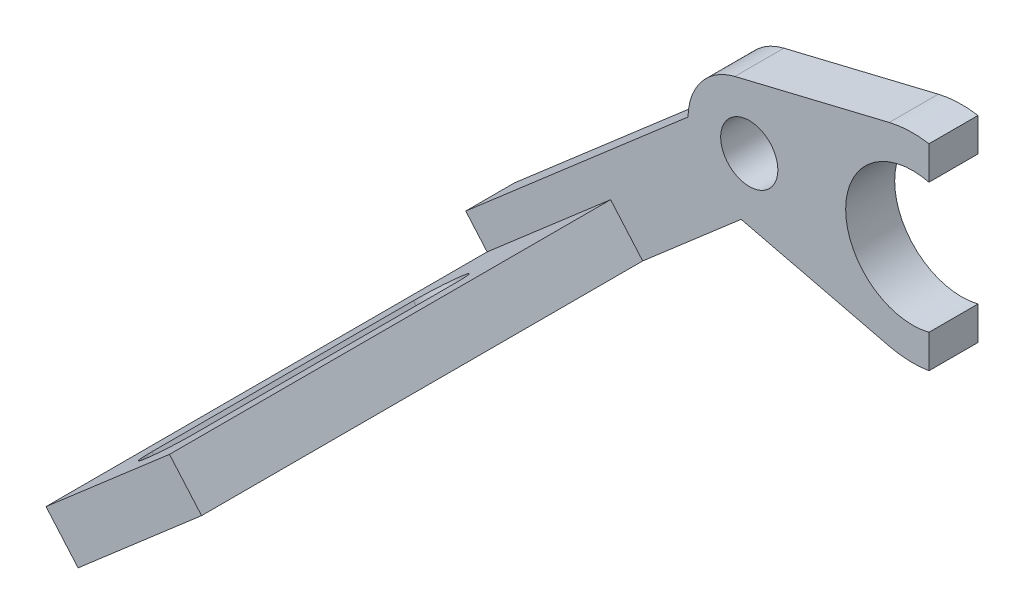
ISO-10303-21;
HEADER;
FILE_DESCRIPTION(('STEP AP214'),'2;1');
FILE_NAME('part.step','',(''),(''),'','','');
FILE_SCHEMA(('AUTOMOTIVE_DESIGN { 1 0 10303 214 1 1 1 1 }'));
ENDSEC;
DATA;
#1=APPLICATION_CONTEXT('core data for automotive mechanical design processes');
#2=APPLICATION_PROTOCOL_DEFINITION('international standard','automotive_design',2000,#1);
#3=PRODUCT_CONTEXT('',#1,'mechanical');
#4=PRODUCT('Part','Part','',(#3));
#5=PRODUCT_RELATED_PRODUCT_CATEGORY('part','',(#4));
#6=PRODUCT_DEFINITION_FORMATION('','',#4);
#7=PRODUCT_DEFINITION_CONTEXT('part definition',#1,'design');
#8=PRODUCT_DEFINITION('design','',#6,#7);
#9=PRODUCT_DEFINITION_SHAPE('','',#8);
#10=(LENGTH_UNIT() NAMED_UNIT(*) SI_UNIT(.MILLI.,.METRE.));
#11=(NAMED_UNIT(*) PLANE_ANGLE_UNIT() SI_UNIT($,.RADIAN.));
#12=(NAMED_UNIT(*) SI_UNIT($,.STERADIAN.) SOLID_ANGLE_UNIT());
#13=UNCERTAINTY_MEASURE_WITH_UNIT(LENGTH_MEASURE(1.E-05),#10,'distance_accuracy_value','');
#14=(GEOMETRIC_REPRESENTATION_CONTEXT(3) GLOBAL_UNCERTAINTY_ASSIGNED_CONTEXT((#13)) GLOBAL_UNIT_ASSIGNED_CONTEXT((#10,
#11,#12)) REPRESENTATION_CONTEXT('',''));
#15=CARTESIAN_POINT('',(0.,0.,0.));
#16=DIRECTION('',(0.,0.,1.));
#17=DIRECTION('',(1.,0.,0.));
#18=AXIS2_PLACEMENT_3D('',#15,#16,#17);
#19=CARTESIAN_POINT('',(-0.88125,3.64498263884754,3.));
#20=DIRECTION('',(-0.235,0.971995370359345,0.));
#21=DIRECTION('',(-0.971995370359345,-0.235,0.));
#22=AXIS2_PLACEMENT_3D('',#19,#20,#21);
#23=PLANE('',#22);
#24=DIRECTION('',(0.971995370359345,0.235,0.));
#25=VECTOR('',#24,1.);
#26=CARTESIAN_POINT('',(-0.88125,3.64498263884754,0.));
#27=LINE('',#26,#25);
#28=CARTESIAN_POINT('',(-0.881249999999999,3.64498263884754,0.));
#29=VERTEX_POINT('',#28);
#30=CARTESIAN_POINT('',(8.5665,5.929171759192,0.));
#31=VERTEX_POINT('',#30);
#32=EDGE_CURVE('E151',#29,#31,#27,.T.);
#33=ORIENTED_EDGE('',*,*,#32,.F.);
#34=DIRECTION('',(0.,0.,-1.));
#35=VECTOR('',#34,1.);
#36=CARTESIAN_POINT('',(-0.881249999999999,3.64498263884754,3.));
#37=LINE('',#36,#35);
#38=CARTESIAN_POINT('',(-0.881249999999999,3.64498263884754,3.));
#39=VERTEX_POINT('',#38);
#40=EDGE_CURVE('E11',#39,#29,#37,.T.);
#41=ORIENTED_EDGE('',*,*,#40,.F.);
#42=DIRECTION('',(0.971995370359345,0.235,0.));
#43=VECTOR('',#42,1.);
#44=CARTESIAN_POINT('',(-0.88125,3.64498263884754,3.));
#45=LINE('',#44,#43);
#46=CARTESIAN_POINT('',(8.5665,5.929171759192,3.));
#47=VERTEX_POINT('',#46);
#48=EDGE_CURVE('E180',#39,#47,#45,.T.);
#49=ORIENTED_EDGE('',*,*,#48,.T.);
#50=DIRECTION('',(0.,0.,-1.));
#51=VECTOR('',#50,1.);
#52=CARTESIAN_POINT('',(8.5665,5.929171759192,3.));
#53=LINE('',#52,#51);
#54=EDGE_CURVE('E95',#47,#31,#53,.T.);
#55=ORIENTED_EDGE('',*,*,#54,.T.);
#56=EDGE_LOOP('',(#33,#41,#49,#55));
#57=FACE_BOUND('',#56,.T.);
#58=ADVANCED_FACE('F35',(#57),#23,.T.);
#59=CARTESIAN_POINT('',(0.,0.,3.));
#60=DIRECTION('',(0.,0.,-1.));
#61=DIRECTION('',(-1.,0.,0.));
#62=AXIS2_PLACEMENT_3D('',#59,#60,#61);
#63=CYLINDRICAL_SURFACE('',#62,3.75);
#64=CARTESIAN_POINT('',(0.,0.,0.));
#65=DIRECTION('',(0.,0.,1.));
#66=DIRECTION('',(1.,0.,0.));
#67=AXIS2_PLACEMENT_3D('',#64,#65,#66);
#68=CIRCLE('',#67,3.75);
#69=CARTESIAN_POINT('',(-3.7495267069032,0.0595774640247476,0.));
#70=VERTEX_POINT('',#69);
#71=EDGE_CURVE('E154',#29,#70,#68,.T.);
#72=ORIENTED_EDGE('',*,*,#71,.T.);
#73=DIRECTION('',(0.,0.,-1.));
#74=VECTOR('',#73,1.);
#75=CARTESIAN_POINT('',(-3.7495267069032,0.0595774640247476,3.));
#76=LINE('',#75,#74);
#77=CARTESIAN_POINT('',(-3.7495267069032,0.0595774640247476,3.));
#78=VERTEX_POINT('',#77);
#79=EDGE_CURVE('E43',#78,#70,#76,.T.);
#80=ORIENTED_EDGE('',*,*,#79,.F.);
#81=CARTESIAN_POINT('',(0.,0.,3.));
#82=DIRECTION('',(0.,0.,1.));
#83=DIRECTION('',(1.,0.,0.));
#84=AXIS2_PLACEMENT_3D('',#81,#82,#83);
#85=CIRCLE('',#84,3.75);
#86=EDGE_CURVE('E226',#39,#78,#85,.T.);
#87=ORIENTED_EDGE('',*,*,#86,.F.);
#88=ORIENTED_EDGE('',*,*,#40,.T.);
#89=EDGE_LOOP('',(#72,#80,#87,#88));
#90=FACE_BOUND('',#89,.T.);
#91=ADVANCED_FACE('F370',(#90),#63,.T.);
#92=CARTESIAN_POINT('',(-1.63685203429334,1.88963367291911,3.));
#93=DIRECTION('',(0.654740813717336,-0.755853469167643,0.));
#94=DIRECTION('',(0.755853469167643,0.654740813717336,0.));
#95=AXIS2_PLACEMENT_3D('',#92,#93,#94);
#96=PLANE('',#95);
#97=DIRECTION('',(-0.755853469167643,-0.654740813717336,0.));
#98=VECTOR('',#97,1.);
#99=CARTESIAN_POINT('',(-1.63685203429334,1.88963367291911,0.));
#100=LINE('',#99,#98);
#101=CARTESIAN_POINT('',(-17.3548891519208,-11.7257571828873,0.));
#102=VERTEX_POINT('',#101);
#103=EDGE_CURVE('E157',#70,#102,#100,.T.);
#104=ORIENTED_EDGE('',*,*,#103,.T.);
#105=DIRECTION('',(0.,0.,-1.));
#106=VECTOR('',#105,1.);
#107=CARTESIAN_POINT('',(-17.3548891519208,-11.7257571828873,3.));
#108=LINE('',#107,#106);
#109=CARTESIAN_POINT('',(-17.3548891519208,-11.7257571828873,3.));
#110=VERTEX_POINT('',#109);
#111=EDGE_CURVE('E194',#110,#102,#108,.T.);
#112=ORIENTED_EDGE('',*,*,#111,.F.);
#113=DIRECTION('',(-0.755853469167643,-0.654740813717336,0.));
#114=VECTOR('',#113,1.);
#115=CARTESIAN_POINT('',(-1.63685203429334,1.88963367291911,3.));
#116=LINE('',#115,#114);
#117=EDGE_CURVE('E204',#78,#110,#116,.T.);
#118=ORIENTED_EDGE('',*,*,#117,.F.);
#119=ORIENTED_EDGE('',*,*,#79,.T.);
#120=EDGE_LOOP('',(#104,#112,#118,#119));
#121=FACE_BOUND('',#120,.T.);
#122=ADVANCED_FACE('F201',(#121),#96,.F.);
#123=CARTESIAN_POINT('',(-15.7180371176274,-13.6153908558064,3.));
#124=DIRECTION('',(-0.755853469167643,-0.654740813717336,0.));
#125=DIRECTION('',(0.654740813717336,-0.755853469167643,0.));
#126=AXIS2_PLACEMENT_3D('',#123,#124,#125);
#127=PLANE('',#126);
#128=ORIENTED_EDGE('',*,*,#111,.T.);
#129=DIRECTION('',(-0.654740813717336,0.755853469167643,0.));
#130=VECTOR('',#129,1.);
#131=CARTESIAN_POINT('',(-15.7180371176274,-13.6153908558064,0.));
#132=LINE('',#131,#130);
#133=CARTESIAN_POINT('',(-14.0811850833341,-15.5050245287255,0.));
#134=VERTEX_POINT('',#133);
#135=EDGE_CURVE('E160',#134,#102,#132,.T.);
#136=ORIENTED_EDGE('',*,*,#135,.F.);
#137=DIRECTION('',(0.,0.,-1.));
#138=VECTOR('',#137,1.);
#139=CARTESIAN_POINT('',(-14.0811850833341,-15.5050245287255,3.));
#140=LINE('',#139,#138);
#141=CARTESIAN_POINT('',(-14.0811850833341,-15.5050245287255,30.));
#142=VERTEX_POINT('',#141);
#143=EDGE_CURVE('E191',#142,#134,#140,.T.);
#144=ORIENTED_EDGE('',*,*,#143,.F.);
#145=DIRECTION('',(0.654740813717335,-0.755853469167643,0.));
#146=VECTOR('',#145,1.);
#147=CARTESIAN_POINT('',(-16.0454075244861,-13.2374641212226,30.));
#148=LINE('',#147,#146);
#149=CARTESIAN_POINT('',(-16.0454075244861,-13.2374641212226,30.));
#150=VERTEX_POINT('',#149);
#151=EDGE_CURVE('E248',#150,#142,#148,.T.);
#152=ORIENTED_EDGE('',*,*,#151,.F.);
#153=DIRECTION('',(0.,0.,-1.));
#154=VECTOR('',#153,1.);
#155=CARTESIAN_POINT('',(-16.0454075244861,-13.2374641212226,0.));
#156=LINE('',#155,#154);
#157=CARTESIAN_POINT('',(-16.0454075244861,-13.2374641212226,3.));
#158=VERTEX_POINT('',#157);
#159=EDGE_CURVE('E222',#150,#158,#156,.T.);
#160=ORIENTED_EDGE('',*,*,#159,.T.);
#161=DIRECTION('',(-0.654740813717336,0.755853469167643,0.));
#162=VECTOR('',#161,1.);
#163=CARTESIAN_POINT('',(-15.7180371176274,-13.6153908558064,3.));
#164=LINE('',#163,#162);
#165=EDGE_CURVE('E218',#158,#110,#164,.T.);
#166=ORIENTED_EDGE('',*,*,#165,.T.);
#167=EDGE_LOOP('',(#128,#136,#144,#152,#160,#166));
#168=FACE_BOUND('',#167,.T.);
#169=ADVANCED_FACE('F215',(#168),#127,.T.);
#170=CARTESIAN_POINT('',(1.63685203429334,-1.88963367291911,3.));
#171=DIRECTION('',(0.654740813717336,-0.755853469167643,0.));
#172=DIRECTION('',(0.755853469167643,0.654740813717336,0.));
#173=AXIS2_PLACEMENT_3D('',#170,#171,#172);
#174=PLANE('',#173);
#175=DIRECTION('',(-0.755853469167643,-0.654740813717336,0.));
#176=VECTOR('',#175,1.);
#177=CARTESIAN_POINT('',(1.63685203429334,-1.88963367291911,3.));
#178=LINE('',#177,#176);
#179=CARTESIAN_POINT('',(-0.496863485241732,-3.73791603516074,3.));
#180=VERTEX_POINT('',#179);
#181=CARTESIAN_POINT('',(-6.52265039165767,-8.95761639155215,3.));
#182=VERTEX_POINT('',#181);
#183=EDGE_CURVE('E224',#180,#182,#178,.T.);
#184=ORIENTED_EDGE('',*,*,#183,.T.);
#185=DIRECTION('',(0.,0.,1.));
#186=VECTOR('',#185,1.);
#187=CARTESIAN_POINT('',(-6.52265039165767,-8.95761639155215,0.));
#188=LINE('',#187,#186);
#189=CARTESIAN_POINT('',(-6.52265039165767,-8.95761639155215,30.));
#190=VERTEX_POINT('',#189);
#191=EDGE_CURVE('E258',#182,#190,#188,.T.);
#192=ORIENTED_EDGE('',*,*,#191,.T.);
#193=DIRECTION('',(-0.755853469167643,-0.654740813717335,0.));
#194=VECTOR('',#193,1.);
#195=CARTESIAN_POINT('',(-14.0811850833341,-15.5050245287255,30.));
#196=LINE('',#195,#194);
#197=EDGE_CURVE('E255',#190,#142,#196,.T.);
#198=ORIENTED_EDGE('',*,*,#197,.T.);
#199=ORIENTED_EDGE('',*,*,#143,.T.);
#200=DIRECTION('',(-0.755853469167643,-0.654740813717336,0.));
#201=VECTOR('',#200,1.);
#202=CARTESIAN_POINT('',(1.63685203429334,-1.88963367291911,0.));
#203=LINE('',#202,#201);
#204=CARTESIAN_POINT('',(-0.496863485241732,-3.73791603516074,0.));
#205=VERTEX_POINT('',#204);
#206=EDGE_CURVE('E162',#205,#134,#203,.T.);
#207=ORIENTED_EDGE('',*,*,#206,.F.);
#208=DIRECTION('',(0.,0.,-1.));
#209=VECTOR('',#208,1.);
#210=CARTESIAN_POINT('',(-0.496863485241732,-3.73791603516074,3.));
#211=LINE('',#210,#209);
#212=EDGE_CURVE('E189',#180,#205,#211,.T.);
#213=ORIENTED_EDGE('',*,*,#212,.F.);
#214=EDGE_LOOP('',(#184,#192,#198,#199,#207,#213));
#215=FACE_BOUND('',#214,.T.);
#216=DIRECTION('',(0.,0.,-1.));
#217=VECTOR('',#216,1.);
#218=CARTESIAN_POINT('',(-11.5868686350809,-13.3443798434583,26.));
#219=LINE('',#218,#217);
#220=CARTESIAN_POINT('',(-11.5868686350809,-13.3443798434583,26.));
#221=VERTEX_POINT('',#220);
#222=CARTESIAN_POINT('',(-11.5868686350809,-13.3443798434583,10.));
#223=VERTEX_POINT('',#222);
#224=EDGE_CURVE('E287',#221,#223,#219,.T.);
#225=ORIENTED_EDGE('',*,*,#224,.F.);
#226=CARTESIAN_POINT('',(-10.3019177374959,-12.2313204601388,26.));
#227=DIRECTION('',(0.654740813717336,-0.755853469167643,0.));
#228=DIRECTION('',(0.755853469167643,0.654740813717336,0.));
#229=AXIS2_PLACEMENT_3D('',#226,#227,#228);
#230=CIRCLE('',#229,1.7);
#231=CARTESIAN_POINT('',(-9.01696683991089,-11.1182610768194,26.));
#232=VERTEX_POINT('',#231);
#233=EDGE_CURVE('E290',#232,#221,#230,.T.);
#234=ORIENTED_EDGE('',*,*,#233,.F.);
#235=DIRECTION('',(0.,0.,1.));
#236=VECTOR('',#235,1.);
#237=CARTESIAN_POINT('',(-9.01696683991089,-11.1182610768194,26.));
#238=LINE('',#237,#236);
#239=CARTESIAN_POINT('',(-9.01696683991089,-11.1182610768194,10.));
#240=VERTEX_POINT('',#239);
#241=EDGE_CURVE('E280',#240,#232,#238,.T.);
#242=ORIENTED_EDGE('',*,*,#241,.F.);
#243=CARTESIAN_POINT('',(-10.3019177374959,-12.2313204601388,10.));
#244=DIRECTION('',(0.654740813717336,-0.755853469167643,0.));
#245=DIRECTION('',(0.755853469167643,0.654740813717336,0.));
#246=AXIS2_PLACEMENT_3D('',#243,#244,#245);
#247=CIRCLE('',#246,1.7);
#248=EDGE_CURVE('E284',#223,#240,#247,.T.);
#249=ORIENTED_EDGE('',*,*,#248,.F.);
#250=EDGE_LOOP('',(#225,#234,#242,#249));
#251=FACE_BOUND('',#250,.T.);
#252=ADVANCED_FACE('F352',(#215,#251),#174,.T.);
#253=CARTESIAN_POINT('',(-0.88125,-3.64498263884754,3.));
#254=DIRECTION('',(0.235,0.971995370359345,0.));
#255=DIRECTION('',(-0.971995370359345,0.235,0.));
#256=AXIS2_PLACEMENT_3D('',#253,#254,#255);
#257=PLANE('',#256);
#258=DIRECTION('',(0.971995370359345,-0.235,0.));
#259=VECTOR('',#258,1.);
#260=CARTESIAN_POINT('',(-0.88125,-3.64498263884754,0.));
#261=LINE('',#260,#259);
#262=CARTESIAN_POINT('',(8.5665,-5.929171759192,0.));
#263=VERTEX_POINT('',#262);
#264=EDGE_CURVE('E164',#205,#263,#261,.T.);
#265=ORIENTED_EDGE('',*,*,#264,.T.);
#266=DIRECTION('',(0.,0.,-1.));
#267=VECTOR('',#266,1.);
#268=CARTESIAN_POINT('',(8.5665,-5.929171759192,3.));
#269=LINE('',#268,#267);
#270=CARTESIAN_POINT('',(8.5665,-5.929171759192,3.));
#271=VERTEX_POINT('',#270);
#272=EDGE_CURVE('E186',#271,#263,#269,.T.);
#273=ORIENTED_EDGE('',*,*,#272,.F.);
#274=DIRECTION('',(0.971995370359345,-0.235,0.));
#275=VECTOR('',#274,1.);
#276=CARTESIAN_POINT('',(-0.88125,-3.64498263884754,3.));
#277=LINE('',#276,#275);
#278=EDGE_CURVE('E233',#180,#271,#277,.T.);
#279=ORIENTED_EDGE('',*,*,#278,.F.);
#280=ORIENTED_EDGE('',*,*,#212,.T.);
#281=EDGE_LOOP('',(#265,#273,#279,#280));
#282=FACE_BOUND('',#281,.T.);
#283=ADVANCED_FACE('F358',(#282),#257,.F.);
#284=CARTESIAN_POINT('',(10.,0.,3.));
#285=DIRECTION('',(0.,0.,-1.));
#286=DIRECTION('',(-1.,0.,0.));
#287=AXIS2_PLACEMENT_3D('',#284,#285,#286);
#288=CYLINDRICAL_SURFACE('',#287,6.1);
#289=CARTESIAN_POINT('',(10.,0.,0.));
#290=DIRECTION('',(0.,0.,1.));
#291=DIRECTION('',(1.,0.,0.));
#292=AXIS2_PLACEMENT_3D('',#289,#290,#291);
#293=CIRCLE('',#292,6.1);
#294=CARTESIAN_POINT('',(11.,-6.01747455333215,0.));
#295=VERTEX_POINT('',#294);
#296=EDGE_CURVE('E166',#263,#295,#293,.T.);
#297=ORIENTED_EDGE('',*,*,#296,.T.);
#298=DIRECTION('',(0.,0.,-1.));
#299=VECTOR('',#298,1.);
#300=CARTESIAN_POINT('',(11.,-6.01747455333215,3.));
#301=LINE('',#300,#299);
#302=CARTESIAN_POINT('',(11.,-6.01747455333215,3.));
#303=VERTEX_POINT('',#302);
#304=EDGE_CURVE('E184',#303,#295,#301,.T.);
#305=ORIENTED_EDGE('',*,*,#304,.F.);
#306=CARTESIAN_POINT('',(10.,0.,3.));
#307=DIRECTION('',(0.,0.,1.));
#308=DIRECTION('',(1.,0.,0.));
#309=AXIS2_PLACEMENT_3D('',#306,#307,#308);
#310=CIRCLE('',#309,6.1);
#311=EDGE_CURVE('E235',#271,#303,#310,.T.);
#312=ORIENTED_EDGE('',*,*,#311,.F.);
#313=ORIENTED_EDGE('',*,*,#272,.T.);
#314=EDGE_LOOP('',(#297,#305,#312,#313));
#315=FACE_BOUND('',#314,.T.);
#316=ADVANCED_FACE('F360',(#315),#288,.T.);
#317=CARTESIAN_POINT('',(11.,0.,3.));
#318=DIRECTION('',(1.,0.,0.));
#319=DIRECTION('',(0.,0.,-1.));
#320=AXIS2_PLACEMENT_3D('',#317,#318,#319);
#321=PLANE('',#320);
#322=DIRECTION('',(0.,-1.,0.));
#323=VECTOR('',#322,1.);
#324=CARTESIAN_POINT('',(11.,0.,0.));
#325=LINE('',#324,#323);
#326=CARTESIAN_POINT('',(11.,-3.97617907041421,0.));
#327=VERTEX_POINT('',#326);
#328=EDGE_CURVE('E169',#327,#295,#325,.T.);
#329=ORIENTED_EDGE('',*,*,#328,.F.);
#330=DIRECTION('',(0.,0.,-1.));
#331=VECTOR('',#330,1.);
#332=CARTESIAN_POINT('',(11.,-3.97617907041421,3.));
#333=LINE('',#332,#331);
#334=CARTESIAN_POINT('',(11.,-3.97617907041421,3.));
#335=VERTEX_POINT('',#334);
#336=EDGE_CURVE('E133',#335,#327,#333,.T.);
#337=ORIENTED_EDGE('',*,*,#336,.F.);
#338=DIRECTION('',(0.,-1.,0.));
#339=VECTOR('',#338,1.);
#340=CARTESIAN_POINT('',(11.,0.,3.));
#341=LINE('',#340,#339);
#342=EDGE_CURVE('E141',#335,#303,#341,.T.);
#343=ORIENTED_EDGE('',*,*,#342,.T.);
#344=ORIENTED_EDGE('',*,*,#304,.T.);
#345=EDGE_LOOP('',(#329,#337,#343,#344));
#346=FACE_BOUND('',#345,.T.);
#347=ADVANCED_FACE('F238',(#346),#321,.T.);
#348=CARTESIAN_POINT('',(10.,0.,3.));
#349=DIRECTION('',(0.,0.,-1.));
#350=DIRECTION('',(-1.,0.,0.));
#351=AXIS2_PLACEMENT_3D('',#348,#349,#350);
#352=CYLINDRICAL_SURFACE('',#351,4.1);
#353=CARTESIAN_POINT('',(10.,0.,0.));
#354=DIRECTION('',(0.,0.,1.));
#355=DIRECTION('',(1.,0.,0.));
#356=AXIS2_PLACEMENT_3D('',#353,#354,#355);
#357=CIRCLE('',#356,4.1);
#358=CARTESIAN_POINT('',(11.,3.97617907041421,0.));
#359=VERTEX_POINT('',#358);
#360=EDGE_CURVE('E128',#359,#327,#357,.T.);
#361=ORIENTED_EDGE('',*,*,#360,.F.);
#362=DIRECTION('',(0.,0.,-1.));
#363=VECTOR('',#362,1.);
#364=CARTESIAN_POINT('',(11.,3.97617907041421,3.));
#365=LINE('',#364,#363);
#366=CARTESIAN_POINT('',(11.,3.97617907041421,3.));
#367=VERTEX_POINT('',#366);
#368=EDGE_CURVE('E123',#367,#359,#365,.T.);
#369=ORIENTED_EDGE('',*,*,#368,.F.);
#370=CARTESIAN_POINT('',(10.,0.,3.));
#371=DIRECTION('',(0.,0.,1.));
#372=DIRECTION('',(1.,0.,0.));
#373=AXIS2_PLACEMENT_3D('',#370,#371,#372);
#374=CIRCLE('',#373,4.1);
#375=EDGE_CURVE('E126',#367,#335,#374,.T.);
#376=ORIENTED_EDGE('',*,*,#375,.T.);
#377=ORIENTED_EDGE('',*,*,#336,.T.);
#378=EDGE_LOOP('',(#361,#369,#376,#377));
#379=FACE_BOUND('',#378,.T.);
#380=ADVANCED_FACE('F125',(#379),#352,.F.);
#381=CARTESIAN_POINT('',(11.,0.,3.));
#382=DIRECTION('',(1.,0.,0.));
#383=DIRECTION('',(0.,0.,-1.));
#384=AXIS2_PLACEMENT_3D('',#381,#382,#383);
#385=PLANE('',#384);
#386=DIRECTION('',(0.,-1.,0.));
#387=VECTOR('',#386,1.);
#388=CARTESIAN_POINT('',(11.,0.,0.));
#389=LINE('',#388,#387);
#390=CARTESIAN_POINT('',(11.,6.01747455333215,0.));
#391=VERTEX_POINT('',#390);
#392=EDGE_CURVE('E173',#391,#359,#389,.T.);
#393=ORIENTED_EDGE('',*,*,#392,.F.);
#394=DIRECTION('',(0.,0.,-1.));
#395=VECTOR('',#394,1.);
#396=CARTESIAN_POINT('',(11.,6.01747455333215,3.));
#397=LINE('',#396,#395);
#398=CARTESIAN_POINT('',(11.,6.01747455333215,3.));
#399=VERTEX_POINT('',#398);
#400=EDGE_CURVE('E88',#399,#391,#397,.T.);
#401=ORIENTED_EDGE('',*,*,#400,.F.);
#402=DIRECTION('',(0.,-1.,0.));
#403=VECTOR('',#402,1.);
#404=CARTESIAN_POINT('',(11.,0.,3.));
#405=LINE('',#404,#403);
#406=EDGE_CURVE('E139',#399,#367,#405,.T.);
#407=ORIENTED_EDGE('',*,*,#406,.T.);
#408=ORIENTED_EDGE('',*,*,#368,.T.);
#409=EDGE_LOOP('',(#393,#401,#407,#408));
#410=FACE_BOUND('',#409,.T.);
#411=ADVANCED_FACE('F143',(#410),#385,.T.);
#412=CARTESIAN_POINT('',(10.,0.,3.));
#413=DIRECTION('',(0.,0.,-1.));
#414=DIRECTION('',(-1.,0.,0.));
#415=AXIS2_PLACEMENT_3D('',#412,#413,#414);
#416=CYLINDRICAL_SURFACE('',#415,6.1);
#417=CARTESIAN_POINT('',(10.,0.,0.));
#418=DIRECTION('',(0.,0.,1.));
#419=DIRECTION('',(1.,0.,0.));
#420=AXIS2_PLACEMENT_3D('',#417,#418,#419);
#421=CIRCLE('',#420,6.1);
#422=EDGE_CURVE('E175',#391,#31,#421,.T.);
#423=ORIENTED_EDGE('',*,*,#422,.T.);
#424=ORIENTED_EDGE('',*,*,#54,.F.);
#425=CARTESIAN_POINT('',(10.,0.,3.));
#426=DIRECTION('',(0.,0.,1.));
#427=DIRECTION('',(1.,0.,0.));
#428=AXIS2_PLACEMENT_3D('',#425,#426,#427);
#429=CIRCLE('',#428,6.1);
#430=EDGE_CURVE('E51',#399,#47,#429,.T.);
#431=ORIENTED_EDGE('',*,*,#430,.F.);
#432=ORIENTED_EDGE('',*,*,#400,.T.);
#433=EDGE_LOOP('',(#423,#424,#431,#432));
#434=FACE_BOUND('',#433,.T.);
#435=ADVANCED_FACE('F241',(#434),#416,.T.);
#436=CARTESIAN_POINT('',(0.,0.,3.));
#437=DIRECTION('',(0.,0.,-1.));
#438=DIRECTION('',(-1.,0.,0.));
#439=AXIS2_PLACEMENT_3D('',#436,#437,#438);
#440=CYLINDRICAL_SURFACE('',#439,1.75);
#441=CARTESIAN_POINT('',(0.,0.,3.));
#442=DIRECTION('',(0.,0.,1.));
#443=DIRECTION('',(1.,0.,0.));
#444=AXIS2_PLACEMENT_3D('',#441,#442,#443);
#445=CIRCLE('',#444,1.75);
#446=CARTESIAN_POINT('',(1.75,0.,3.));
#447=VERTEX_POINT('',#446);
#448=EDGE_CURVE('E145',#447,#447,#445,.T.);
#449=ORIENTED_EDGE('',*,*,#448,.T.);
#450=EDGE_LOOP('',(#449));
#451=FACE_BOUND('',#450,.T.);
#452=CARTESIAN_POINT('',(0.,0.,0.));
#453=DIRECTION('',(0.,0.,1.));
#454=DIRECTION('',(1.,0.,0.));
#455=AXIS2_PLACEMENT_3D('',#452,#453,#454);
#456=CIRCLE('',#455,1.75);
#457=CARTESIAN_POINT('',(1.75,0.,0.));
#458=VERTEX_POINT('',#457);
#459=EDGE_CURVE('E177',#458,#458,#456,.T.);
#460=ORIENTED_EDGE('',*,*,#459,.F.);
#461=EDGE_LOOP('',(#460));
#462=FACE_BOUND('',#461,.T.);
#463=ADVANCED_FACE('F430',(#451,#462),#440,.F.);
#464=CARTESIAN_POINT('',(0.,0.,3.));
#465=DIRECTION('',(0.,0.,1.));
#466=DIRECTION('',(1.,0.,0.));
#467=AXIS2_PLACEMENT_3D('',#464,#465,#466);
#468=PLANE('',#467);
#469=DIRECTION('',(-0.654740813717335,0.755853469167643,0.));
#470=VECTOR('',#469,1.);
#471=CARTESIAN_POINT('',(-8.15950242595101,-7.06798271863304,3.));
#472=LINE('',#471,#470);
#473=CARTESIAN_POINT('',(-8.48687283280968,-6.69005598404922,3.));
#474=VERTEX_POINT('',#473);
#475=EDGE_CURVE('E155',#182,#474,#472,.T.);
#476=ORIENTED_EDGE('',*,*,#475,.F.);
#477=ORIENTED_EDGE('',*,*,#183,.F.);
#478=ORIENTED_EDGE('',*,*,#278,.T.);
#479=ORIENTED_EDGE('',*,*,#311,.T.);
#480=ORIENTED_EDGE('',*,*,#342,.F.);
#481=ORIENTED_EDGE('',*,*,#375,.F.);
#482=ORIENTED_EDGE('',*,*,#406,.F.);
#483=ORIENTED_EDGE('',*,*,#430,.T.);
#484=ORIENTED_EDGE('',*,*,#48,.F.);
#485=ORIENTED_EDGE('',*,*,#86,.T.);
#486=ORIENTED_EDGE('',*,*,#117,.T.);
#487=ORIENTED_EDGE('',*,*,#165,.F.);
#488=DIRECTION('',(-0.755853469167643,-0.654740813717336,0.));
#489=VECTOR('',#488,1.);
#490=CARTESIAN_POINT('',(-0.327370406858665,0.377926734583819,3.));
#491=LINE('',#490,#489);
#492=EDGE_CURVE('E245',#474,#158,#491,.T.);
#493=ORIENTED_EDGE('',*,*,#492,.F.);
#494=EDGE_LOOP('',(#476,#477,#478,#479,#480,#481,#482,#483,#484,#485,#486,#487,#493));
#495=FACE_BOUND('',#494,.T.);
#496=ORIENTED_EDGE('',*,*,#448,.F.);
#497=EDGE_LOOP('',(#496));
#498=FACE_BOUND('',#497,.T.);
#499=ADVANCED_FACE('F137',(#495,#498),#468,.T.);
#500=CARTESIAN_POINT('',(0.,0.,0.));
#501=DIRECTION('',(0.,0.,1.));
#502=DIRECTION('',(1.,0.,0.));
#503=AXIS2_PLACEMENT_3D('',#500,#501,#502);
#504=PLANE('',#503);
#505=ORIENTED_EDGE('',*,*,#206,.T.);
#506=ORIENTED_EDGE('',*,*,#135,.T.);
#507=ORIENTED_EDGE('',*,*,#103,.F.);
#508=ORIENTED_EDGE('',*,*,#71,.F.);
#509=ORIENTED_EDGE('',*,*,#32,.T.);
#510=ORIENTED_EDGE('',*,*,#422,.F.);
#511=ORIENTED_EDGE('',*,*,#392,.T.);
#512=ORIENTED_EDGE('',*,*,#360,.T.);
#513=ORIENTED_EDGE('',*,*,#328,.T.);
#514=ORIENTED_EDGE('',*,*,#296,.F.);
#515=ORIENTED_EDGE('',*,*,#264,.F.);
#516=EDGE_LOOP('',(#505,#506,#507,#508,#509,#510,#511,#512,#513,#514,#515));
#517=FACE_BOUND('',#516,.T.);
#518=ORIENTED_EDGE('',*,*,#459,.T.);
#519=EDGE_LOOP('',(#518));
#520=FACE_BOUND('',#519,.T.);
#521=ADVANCED_FACE('F208',(#517,#520),#504,.F.);
#522=CARTESIAN_POINT('',(-16.0454075244861,-13.2374641212226,30.));
#523=DIRECTION('',(0.,0.,1.));
#524=DIRECTION('',(1.,0.,0.));
#525=AXIS2_PLACEMENT_3D('',#522,#523,#524);
#526=PLANE('',#525);
#527=ORIENTED_EDGE('',*,*,#197,.F.);
#528=DIRECTION('',(0.654740813717335,-0.755853469167643,0.));
#529=VECTOR('',#528,1.);
#530=CARTESIAN_POINT('',(-8.48687283280968,-6.69005598404922,30.));
#531=LINE('',#530,#529);
#532=CARTESIAN_POINT('',(-8.48687283280968,-6.69005598404922,30.));
#533=VERTEX_POINT('',#532);
#534=EDGE_CURVE('E249',#533,#190,#531,.T.);
#535=ORIENTED_EDGE('',*,*,#534,.F.);
#536=DIRECTION('',(-0.755853469167643,-0.654740813717335,0.));
#537=VECTOR('',#536,1.);
#538=CARTESIAN_POINT('',(-16.0454075244861,-13.2374641212226,30.));
#539=LINE('',#538,#537);
#540=EDGE_CURVE('E252',#533,#150,#539,.T.);
#541=ORIENTED_EDGE('',*,*,#540,.T.);
#542=ORIENTED_EDGE('',*,*,#151,.T.);
#543=EDGE_LOOP('',(#527,#535,#541,#542));
#544=FACE_BOUND('',#543,.T.);
#545=ADVANCED_FACE('F350',(#544),#526,.T.);
#546=CARTESIAN_POINT('',(-8.48687283280968,-6.69005598404922,0.));
#547=DIRECTION('',(0.755853469167643,0.654740813717335,0.));
#548=DIRECTION('',(-0.654740813717335,0.755853469167643,0.));
#549=AXIS2_PLACEMENT_3D('',#546,#547,#548);
#550=PLANE('',#549);
#551=ORIENTED_EDGE('',*,*,#191,.F.);
#552=ORIENTED_EDGE('',*,*,#475,.T.);
#553=DIRECTION('',(0.,0.,1.));
#554=VECTOR('',#553,1.);
#555=CARTESIAN_POINT('',(-8.48687283280968,-6.69005598404922,0.));
#556=LINE('',#555,#554);
#557=EDGE_CURVE('E264',#474,#533,#556,.T.);
#558=ORIENTED_EDGE('',*,*,#557,.T.);
#559=ORIENTED_EDGE('',*,*,#534,.T.);
#560=EDGE_LOOP('',(#551,#552,#558,#559));
#561=FACE_BOUND('',#560,.T.);
#562=ADVANCED_FACE('F344',(#561),#550,.T.);
#563=CARTESIAN_POINT('',(-0.327370406858665,0.377926734583819,0.));
#564=DIRECTION('',(-0.654740813717336,0.755853469167643,0.));
#565=DIRECTION('',(-0.755853469167643,-0.654740813717336,0.));
#566=AXIS2_PLACEMENT_3D('',#563,#564,#565);
#567=PLANE('',#566);
#568=CARTESIAN_POINT('',(-12.2661401786479,-9.9637600526359,26.));
#569=DIRECTION('',(0.654740813717336,-0.755853469167643,0.));
#570=DIRECTION('',(0.755853469167643,0.654740813717336,0.));
#571=AXIS2_PLACEMENT_3D('',#568,#569,#570);
#572=CIRCLE('',#571,1.7);
#573=CARTESIAN_POINT('',(-10.9811892810629,-8.85070066931643,26.));
#574=VERTEX_POINT('',#573);
#575=CARTESIAN_POINT('',(-13.5510910762329,-11.0768194359554,26.));
#576=VERTEX_POINT('',#575);
#577=EDGE_CURVE('E283',#574,#576,#572,.T.);
#578=ORIENTED_EDGE('',*,*,#577,.T.);
#579=DIRECTION('',(0.,0.,-1.));
#580=VECTOR('',#579,1.);
#581=CARTESIAN_POINT('',(-13.5510910762329,-11.0768194359554,26.));
#582=LINE('',#581,#580);
#583=CARTESIAN_POINT('',(-13.5510910762329,-11.0768194359554,10.));
#584=VERTEX_POINT('',#583);
#585=EDGE_CURVE('E298',#576,#584,#582,.T.);
#586=ORIENTED_EDGE('',*,*,#585,.T.);
#587=CARTESIAN_POINT('',(-12.2661401786479,-9.9637600526359,10.));
#588=DIRECTION('',(0.654740813717336,-0.755853469167643,0.));
#589=DIRECTION('',(0.755853469167643,0.654740813717336,0.));
#590=AXIS2_PLACEMENT_3D('',#587,#588,#589);
#591=CIRCLE('',#590,1.7);
#592=CARTESIAN_POINT('',(-10.9811892810629,-8.85070066931643,10.));
#593=VERTEX_POINT('',#592);
#594=EDGE_CURVE('E295',#584,#593,#591,.T.);
#595=ORIENTED_EDGE('',*,*,#594,.T.);
#596=DIRECTION('',(0.,0.,1.));
#597=VECTOR('',#596,1.);
#598=CARTESIAN_POINT('',(-10.9811892810629,-8.85070066931643,26.));
#599=LINE('',#598,#597);
#600=EDGE_CURVE('E272',#593,#574,#599,.T.);
#601=ORIENTED_EDGE('',*,*,#600,.T.);
#602=EDGE_LOOP('',(#578,#586,#595,#601));
#603=FACE_BOUND('',#602,.T.);
#604=ORIENTED_EDGE('',*,*,#557,.F.);
#605=ORIENTED_EDGE('',*,*,#492,.T.);
#606=ORIENTED_EDGE('',*,*,#159,.F.);
#607=ORIENTED_EDGE('',*,*,#540,.F.);
#608=EDGE_LOOP('',(#604,#605,#606,#607));
#609=FACE_BOUND('',#608,.T.);
#610=ADVANCED_FACE('F305',(#603,#609),#567,.T.);
#611=CARTESIAN_POINT('',(-12.2661401786479,-9.9637600526359,26.));
#612=DIRECTION('',(0.654740813717335,-0.755853469167643,0.));
#613=DIRECTION('',(0.755853469167643,0.654740813717335,0.));
#614=AXIS2_PLACEMENT_3D('',#611,#612,#613);
#615=CYLINDRICAL_SURFACE('',#614,1.7);
#616=ORIENTED_EDGE('',*,*,#233,.T.);
#617=DIRECTION('',(0.654740813717335,-0.755853469167643,0.));
#618=VECTOR('',#617,1.);
#619=CARTESIAN_POINT('',(-13.5510910762329,-11.0768194359554,26.));
#620=LINE('',#619,#618);
#621=EDGE_CURVE('E268',#576,#221,#620,.T.);
#622=ORIENTED_EDGE('',*,*,#621,.F.);
#623=ORIENTED_EDGE('',*,*,#577,.F.);
#624=DIRECTION('',(0.654740813717335,-0.755853469167643,0.));
#625=VECTOR('',#624,1.);
#626=CARTESIAN_POINT('',(-10.9811892810629,-8.85070066931643,26.));
#627=LINE('',#626,#625);
#628=EDGE_CURVE('E261',#574,#232,#627,.T.);
#629=ORIENTED_EDGE('',*,*,#628,.T.);
#630=EDGE_LOOP('',(#616,#622,#623,#629));
#631=FACE_BOUND('',#630,.T.);
#632=ADVANCED_FACE('F316',(#631),#615,.F.);
#633=CARTESIAN_POINT('',(-10.9811892810629,-8.85070066931643,26.));
#634=DIRECTION('',(0.755853469167643,0.654740813717335,0.));
#635=DIRECTION('',(-0.654740813717335,0.755853469167643,0.));
#636=AXIS2_PLACEMENT_3D('',#633,#634,#635);
#637=PLANE('',#636);
#638=ORIENTED_EDGE('',*,*,#241,.T.);
#639=ORIENTED_EDGE('',*,*,#628,.F.);
#640=ORIENTED_EDGE('',*,*,#600,.F.);
#641=DIRECTION('',(0.654740813717335,-0.755853469167643,0.));
#642=VECTOR('',#641,1.);
#643=CARTESIAN_POINT('',(-10.9811892810629,-8.85070066931643,10.));
#644=LINE('',#643,#642);
#645=EDGE_CURVE('E275',#593,#240,#644,.T.);
#646=ORIENTED_EDGE('',*,*,#645,.T.);
#647=EDGE_LOOP('',(#638,#639,#640,#646));
#648=FACE_BOUND('',#647,.T.);
#649=ADVANCED_FACE('F488',(#648),#637,.F.);
#650=CARTESIAN_POINT('',(-12.2661401786479,-9.9637600526359,10.));
#651=DIRECTION('',(0.654740813717335,-0.755853469167643,0.));
#652=DIRECTION('',(0.755853469167643,0.654740813717335,0.));
#653=AXIS2_PLACEMENT_3D('',#650,#651,#652);
#654=CYLINDRICAL_SURFACE('',#653,1.7);
#655=ORIENTED_EDGE('',*,*,#248,.T.);
#656=ORIENTED_EDGE('',*,*,#645,.F.);
#657=ORIENTED_EDGE('',*,*,#594,.F.);
#658=DIRECTION('',(0.654740813717335,-0.755853469167643,0.));
#659=VECTOR('',#658,1.);
#660=CARTESIAN_POINT('',(-13.5510910762329,-11.0768194359554,10.));
#661=LINE('',#660,#659);
#662=EDGE_CURVE('E271',#584,#223,#661,.T.);
#663=ORIENTED_EDGE('',*,*,#662,.T.);
#664=EDGE_LOOP('',(#655,#656,#657,#663));
#665=FACE_BOUND('',#664,.T.);
#666=ADVANCED_FACE('F496',(#665),#654,.F.);
#667=CARTESIAN_POINT('',(-13.5510910762329,-11.0768194359554,26.));
#668=DIRECTION('',(-0.755853469167643,-0.654740813717335,0.));
#669=DIRECTION('',(0.654740813717335,-0.755853469167643,0.));
#670=AXIS2_PLACEMENT_3D('',#667,#668,#669);
#671=PLANE('',#670);
#672=ORIENTED_EDGE('',*,*,#224,.T.);
#673=ORIENTED_EDGE('',*,*,#662,.F.);
#674=ORIENTED_EDGE('',*,*,#585,.F.);
#675=ORIENTED_EDGE('',*,*,#621,.T.);
#676=EDGE_LOOP('',(#672,#673,#674,#675));
#677=FACE_BOUND('',#676,.T.);
#678=ADVANCED_FACE('F504',(#677),#671,.F.);
#679=CLOSED_SHELL('',(#58,#91,#122,#169,#252,#283,#316,#347,#380,#411,#435,#463,#499,#521,#545,
#562,#610,#632,#649,#666,#678));
#680=MANIFOLD_SOLID_BREP('B2',#679);
#681=ADVANCED_BREP_SHAPE_REPRESENTATION('',(#18,#680),#14);
#682=SHAPE_DEFINITION_REPRESENTATION(#9,#681);
ENDSEC;
END-ISO-10303-21;
